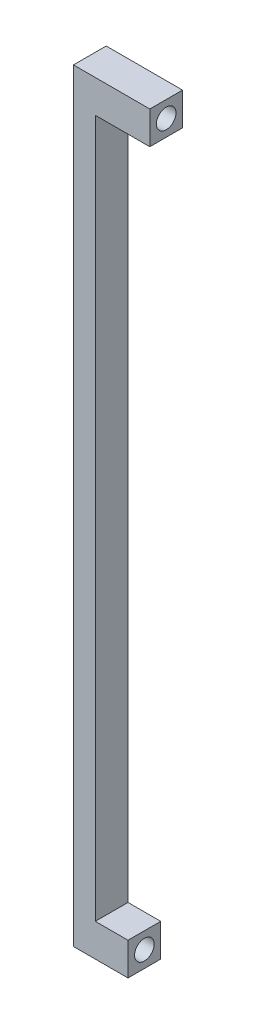
ISO-10303-21;
HEADER;
FILE_DESCRIPTION(('STEP AP214'),'2;1');
FILE_NAME('part.step','',(''),(''),'','','');
FILE_SCHEMA(('AUTOMOTIVE_DESIGN { 1 0 10303 214 1 1 1 1 }'));
ENDSEC;
DATA;
#1=APPLICATION_CONTEXT('core data for automotive mechanical design processes');
#2=APPLICATION_PROTOCOL_DEFINITION('international standard','automotive_design',2000,#1);
#3=PRODUCT_CONTEXT('',#1,'mechanical');
#4=PRODUCT('Part','Part','',(#3));
#5=PRODUCT_RELATED_PRODUCT_CATEGORY('part','',(#4));
#6=PRODUCT_DEFINITION_FORMATION('','',#4);
#7=PRODUCT_DEFINITION_CONTEXT('part definition',#1,'design');
#8=PRODUCT_DEFINITION('design','',#6,#7);
#9=PRODUCT_DEFINITION_SHAPE('','',#8);
#10=(LENGTH_UNIT() NAMED_UNIT(*) SI_UNIT(.MILLI.,.METRE.));
#11=(NAMED_UNIT(*) PLANE_ANGLE_UNIT() SI_UNIT($,.RADIAN.));
#12=(NAMED_UNIT(*) SI_UNIT($,.STERADIAN.) SOLID_ANGLE_UNIT());
#13=UNCERTAINTY_MEASURE_WITH_UNIT(LENGTH_MEASURE(1.E-05),#10,'distance_accuracy_value','');
#14=(GEOMETRIC_REPRESENTATION_CONTEXT(3) GLOBAL_UNCERTAINTY_ASSIGNED_CONTEXT((#13)) GLOBAL_UNIT_ASSIGNED_CONTEXT((#10,
#11,#12)) REPRESENTATION_CONTEXT('',''));
#15=CARTESIAN_POINT('',(0.,0.,0.));
#16=DIRECTION('',(0.,0.,1.));
#17=DIRECTION('',(1.,0.,0.));
#18=AXIS2_PLACEMENT_3D('',#15,#16,#17);
#19=CARTESIAN_POINT('',(14.,0.,6.));
#20=DIRECTION('',(1.,0.,0.));
#21=DIRECTION('',(0.,1.,0.));
#22=AXIS2_PLACEMENT_3D('',#19,#20,#21);
#23=PLANE('',#22);
#24=CARTESIAN_POINT('',(14.,137.,3.));
#25=DIRECTION('',(1.,0.,0.));
#26=DIRECTION('',(0.,0.,-1.));
#27=AXIS2_PLACEMENT_3D('',#24,#25,#26);
#28=CIRCLE('',#27,1.8);
#29=CARTESIAN_POINT('',(14.,137.,1.2));
#30=VERTEX_POINT('',#29);
#31=EDGE_CURVE('E187',#30,#30,#28,.T.);
#32=ORIENTED_EDGE('',*,*,#31,.F.);
#33=EDGE_LOOP('',(#32));
#34=FACE_BOUND('',#33,.T.);
#35=DIRECTION('',(0.,-1.,0.));
#36=VECTOR('',#35,1.);
#37=CARTESIAN_POINT('',(14.,0.,0.));
#38=LINE('',#37,#36);
#39=CARTESIAN_POINT('',(14.,140.,0.));
#40=VERTEX_POINT('',#39);
#41=CARTESIAN_POINT('',(14.,134.,0.));
#42=VERTEX_POINT('',#41);
#43=EDGE_CURVE('E129',#40,#42,#38,.T.);
#44=ORIENTED_EDGE('',*,*,#43,.F.);
#45=DIRECTION('',(0.,0.,-1.));
#46=VECTOR('',#45,1.);
#47=CARTESIAN_POINT('',(14.,140.,6.));
#48=LINE('',#47,#46);
#49=CARTESIAN_POINT('',(14.,140.,6.));
#50=VERTEX_POINT('',#49);
#51=EDGE_CURVE('E11',#50,#40,#48,.T.);
#52=ORIENTED_EDGE('',*,*,#51,.F.);
#53=DIRECTION('',(0.,-1.,0.));
#54=VECTOR('',#53,1.);
#55=CARTESIAN_POINT('',(14.,0.,6.));
#56=LINE('',#55,#54);
#57=CARTESIAN_POINT('',(14.,134.,6.));
#58=VERTEX_POINT('',#57);
#59=EDGE_CURVE('E148',#50,#58,#56,.T.);
#60=ORIENTED_EDGE('',*,*,#59,.T.);
#61=DIRECTION('',(0.,0.,-1.));
#62=VECTOR('',#61,1.);
#63=CARTESIAN_POINT('',(14.,134.,6.));
#64=LINE('',#63,#62);
#65=EDGE_CURVE('E84',#58,#42,#64,.T.);
#66=ORIENTED_EDGE('',*,*,#65,.T.);
#67=EDGE_LOOP('',(#44,#52,#60,#66));
#68=FACE_BOUND('',#67,.T.);
#69=ADVANCED_FACE('F33',(#34,#68),#23,.T.);
#70=CARTESIAN_POINT('',(0.,140.,6.));
#71=DIRECTION('',(0.,1.,0.));
#72=DIRECTION('',(0.,0.,1.));
#73=AXIS2_PLACEMENT_3D('',#70,#71,#72);
#74=PLANE('',#73);
#75=DIRECTION('',(1.,0.,0.));
#76=VECTOR('',#75,1.);
#77=CARTESIAN_POINT('',(0.,140.,0.));
#78=LINE('',#77,#76);
#79=CARTESIAN_POINT('',(0.,140.,0.));
#80=VERTEX_POINT('',#79);
#81=EDGE_CURVE('E132',#80,#40,#78,.T.);
#82=ORIENTED_EDGE('',*,*,#81,.F.);
#83=DIRECTION('',(0.,0.,-1.));
#84=VECTOR('',#83,1.);
#85=CARTESIAN_POINT('',(0.,140.,6.));
#86=LINE('',#85,#84);
#87=CARTESIAN_POINT('',(0.,140.,6.));
#88=VERTEX_POINT('',#87);
#89=EDGE_CURVE('E41',#88,#80,#86,.T.);
#90=ORIENTED_EDGE('',*,*,#89,.F.);
#91=DIRECTION('',(1.,0.,0.));
#92=VECTOR('',#91,1.);
#93=CARTESIAN_POINT('',(0.,140.,6.));
#94=LINE('',#93,#92);
#95=EDGE_CURVE('E180',#88,#50,#94,.T.);
#96=ORIENTED_EDGE('',*,*,#95,.T.);
#97=ORIENTED_EDGE('',*,*,#51,.T.);
#98=EDGE_LOOP('',(#82,#90,#96,#97));
#99=FACE_BOUND('',#98,.T.);
#100=ADVANCED_FACE('F166',(#99),#74,.T.);
#101=CARTESIAN_POINT('',(0.,0.,6.));
#102=DIRECTION('',(-1.,0.,0.));
#103=DIRECTION('',(0.,-1.,0.));
#104=AXIS2_PLACEMENT_3D('',#101,#102,#103);
#105=PLANE('',#104);
#106=DIRECTION('',(0.,1.,0.));
#107=VECTOR('',#106,1.);
#108=CARTESIAN_POINT('',(0.,0.,0.));
#109=LINE('',#108,#107);
#110=CARTESIAN_POINT('',(0.,0.,0.));
#111=VERTEX_POINT('',#110);
#112=EDGE_CURVE('E136',#111,#80,#109,.T.);
#113=ORIENTED_EDGE('',*,*,#112,.F.);
#114=DIRECTION('',(0.,0.,-1.));
#115=VECTOR('',#114,1.);
#116=CARTESIAN_POINT('',(0.,0.,6.));
#117=LINE('',#116,#115);
#118=CARTESIAN_POINT('',(0.,0.,6.));
#119=VERTEX_POINT('',#118);
#120=EDGE_CURVE('E155',#119,#111,#117,.T.);
#121=ORIENTED_EDGE('',*,*,#120,.F.);
#122=DIRECTION('',(0.,1.,0.));
#123=VECTOR('',#122,1.);
#124=CARTESIAN_POINT('',(0.,0.,6.));
#125=LINE('',#124,#123);
#126=EDGE_CURVE('E162',#119,#88,#125,.T.);
#127=ORIENTED_EDGE('',*,*,#126,.T.);
#128=ORIENTED_EDGE('',*,*,#89,.T.);
#129=EDGE_LOOP('',(#113,#121,#127,#128));
#130=FACE_BOUND('',#129,.T.);
#131=ADVANCED_FACE('F160',(#130),#105,.T.);
#132=CARTESIAN_POINT('',(0.,0.,6.));
#133=DIRECTION('',(0.,1.,0.));
#134=DIRECTION('',(0.,0.,1.));
#135=AXIS2_PLACEMENT_3D('',#132,#133,#134);
#136=PLANE('',#135);
#137=DIRECTION('',(1.,0.,0.));
#138=VECTOR('',#137,1.);
#139=CARTESIAN_POINT('',(0.,0.,0.));
#140=LINE('',#139,#138);
#141=CARTESIAN_POINT('',(10.,0.,0.));
#142=VERTEX_POINT('',#141);
#143=EDGE_CURVE('E139',#111,#142,#140,.T.);
#144=ORIENTED_EDGE('',*,*,#143,.T.);
#145=DIRECTION('',(0.,0.,-1.));
#146=VECTOR('',#145,1.);
#147=CARTESIAN_POINT('',(10.,0.,6.));
#148=LINE('',#147,#146);
#149=CARTESIAN_POINT('',(10.,0.,6.));
#150=VERTEX_POINT('',#149);
#151=EDGE_CURVE('E152',#150,#142,#148,.T.);
#152=ORIENTED_EDGE('',*,*,#151,.F.);
#153=DIRECTION('',(1.,0.,0.));
#154=VECTOR('',#153,1.);
#155=CARTESIAN_POINT('',(0.,0.,6.));
#156=LINE('',#155,#154);
#157=EDGE_CURVE('E124',#119,#150,#156,.T.);
#158=ORIENTED_EDGE('',*,*,#157,.F.);
#159=ORIENTED_EDGE('',*,*,#120,.T.);
#160=EDGE_LOOP('',(#144,#152,#158,#159));
#161=FACE_BOUND('',#160,.T.);
#162=ADVANCED_FACE('F173',(#161),#136,.F.);
#163=CARTESIAN_POINT('',(10.,0.,6.));
#164=DIRECTION('',(-1.,0.,0.));
#165=DIRECTION('',(0.,-1.,0.));
#166=AXIS2_PLACEMENT_3D('',#163,#164,#165);
#167=PLANE('',#166);
#168=CARTESIAN_POINT('',(10.,3.,3.));
#169=DIRECTION('',(1.,0.,0.));
#170=DIRECTION('',(0.,0.,-1.));
#171=AXIS2_PLACEMENT_3D('',#168,#169,#170);
#172=CIRCLE('',#171,1.79999999999999);
#173=CARTESIAN_POINT('',(10.,3.,1.20000000000001));
#174=VERTEX_POINT('',#173);
#175=EDGE_CURVE('E193',#174,#174,#172,.T.);
#176=ORIENTED_EDGE('',*,*,#175,.F.);
#177=EDGE_LOOP('',(#176));
#178=FACE_BOUND('',#177,.T.);
#179=DIRECTION('',(0.,1.,0.));
#180=VECTOR('',#179,1.);
#181=CARTESIAN_POINT('',(10.,0.,0.));
#182=LINE('',#181,#180);
#183=CARTESIAN_POINT('',(10.,6.,0.));
#184=VERTEX_POINT('',#183);
#185=EDGE_CURVE('E141',#142,#184,#182,.T.);
#186=ORIENTED_EDGE('',*,*,#185,.T.);
#187=DIRECTION('',(0.,0.,-1.));
#188=VECTOR('',#187,1.);
#189=CARTESIAN_POINT('',(10.,6.,6.));
#190=LINE('',#189,#188);
#191=CARTESIAN_POINT('',(10.,6.,6.));
#192=VERTEX_POINT('',#191);
#193=EDGE_CURVE('E113',#192,#184,#190,.T.);
#194=ORIENTED_EDGE('',*,*,#193,.F.);
#195=DIRECTION('',(0.,1.,0.));
#196=VECTOR('',#195,1.);
#197=CARTESIAN_POINT('',(10.,0.,6.));
#198=LINE('',#197,#196);
#199=EDGE_CURVE('E121',#150,#192,#198,.T.);
#200=ORIENTED_EDGE('',*,*,#199,.F.);
#201=ORIENTED_EDGE('',*,*,#151,.T.);
#202=EDGE_LOOP('',(#186,#194,#200,#201));
#203=FACE_BOUND('',#202,.T.);
#204=ADVANCED_FACE('F176',(#178,#203),#167,.F.);
#205=CARTESIAN_POINT('',(0.,6.,6.));
#206=DIRECTION('',(0.,1.,0.));
#207=DIRECTION('',(0.,0.,1.));
#208=AXIS2_PLACEMENT_3D('',#205,#206,#207);
#209=PLANE('',#208);
#210=DIRECTION('',(1.,0.,0.));
#211=VECTOR('',#210,1.);
#212=CARTESIAN_POINT('',(0.,6.,0.));
#213=LINE('',#212,#211);
#214=CARTESIAN_POINT('',(4.,6.,0.));
#215=VERTEX_POINT('',#214);
#216=EDGE_CURVE('E112',#215,#184,#213,.T.);
#217=ORIENTED_EDGE('',*,*,#216,.F.);
#218=DIRECTION('',(0.,0.,-1.));
#219=VECTOR('',#218,1.);
#220=CARTESIAN_POINT('',(4.,6.,6.));
#221=LINE('',#220,#219);
#222=CARTESIAN_POINT('',(4.,6.,6.));
#223=VERTEX_POINT('',#222);
#224=EDGE_CURVE('E106',#223,#215,#221,.T.);
#225=ORIENTED_EDGE('',*,*,#224,.F.);
#226=DIRECTION('',(1.,0.,0.));
#227=VECTOR('',#226,1.);
#228=CARTESIAN_POINT('',(0.,6.,6.));
#229=LINE('',#228,#227);
#230=EDGE_CURVE('E110',#223,#192,#229,.T.);
#231=ORIENTED_EDGE('',*,*,#230,.T.);
#232=ORIENTED_EDGE('',*,*,#193,.T.);
#233=EDGE_LOOP('',(#217,#225,#231,#232));
#234=FACE_BOUND('',#233,.T.);
#235=ADVANCED_FACE('F108',(#234),#209,.T.);
#236=CARTESIAN_POINT('',(4.,0.,6.));
#237=DIRECTION('',(-1.,0.,0.));
#238=DIRECTION('',(0.,0.,1.));
#239=AXIS2_PLACEMENT_3D('',#236,#237,#238);
#240=PLANE('',#239);
#241=DIRECTION('',(0.,1.,0.));
#242=VECTOR('',#241,1.);
#243=CARTESIAN_POINT('',(4.,0.,0.));
#244=LINE('',#243,#242);
#245=CARTESIAN_POINT('',(4.,134.,0.));
#246=VERTEX_POINT('',#245);
#247=EDGE_CURVE('E77',#215,#246,#244,.T.);
#248=ORIENTED_EDGE('',*,*,#247,.T.);
#249=DIRECTION('',(0.,0.,-1.));
#250=VECTOR('',#249,1.);
#251=CARTESIAN_POINT('',(4.,134.,6.));
#252=LINE('',#251,#250);
#253=CARTESIAN_POINT('',(4.,134.,6.));
#254=VERTEX_POINT('',#253);
#255=EDGE_CURVE('E114',#254,#246,#252,.T.);
#256=ORIENTED_EDGE('',*,*,#255,.F.);
#257=DIRECTION('',(0.,1.,0.));
#258=VECTOR('',#257,1.);
#259=CARTESIAN_POINT('',(4.,0.,6.));
#260=LINE('',#259,#258);
#261=EDGE_CURVE('E116',#223,#254,#260,.T.);
#262=ORIENTED_EDGE('',*,*,#261,.F.);
#263=ORIENTED_EDGE('',*,*,#224,.T.);
#264=EDGE_LOOP('',(#248,#256,#262,#263));
#265=FACE_BOUND('',#264,.T.);
#266=ADVANCED_FACE('F117',(#265),#240,.F.);
#267=CARTESIAN_POINT('',(0.,134.,6.));
#268=DIRECTION('',(0.,1.,0.));
#269=DIRECTION('',(0.,0.,1.));
#270=AXIS2_PLACEMENT_3D('',#267,#268,#269);
#271=PLANE('',#270);
#272=DIRECTION('',(1.,0.,0.));
#273=VECTOR('',#272,1.);
#274=CARTESIAN_POINT('',(0.,134.,0.));
#275=LINE('',#274,#273);
#276=EDGE_CURVE('E146',#246,#42,#275,.T.);
#277=ORIENTED_EDGE('',*,*,#276,.T.);
#278=ORIENTED_EDGE('',*,*,#65,.F.);
#279=DIRECTION('',(1.,0.,0.));
#280=VECTOR('',#279,1.);
#281=CARTESIAN_POINT('',(0.,134.,6.));
#282=LINE('',#281,#280);
#283=EDGE_CURVE('E49',#254,#58,#282,.T.);
#284=ORIENTED_EDGE('',*,*,#283,.F.);
#285=ORIENTED_EDGE('',*,*,#255,.T.);
#286=EDGE_LOOP('',(#277,#278,#284,#285));
#287=FACE_BOUND('',#286,.T.);
#288=ADVANCED_FACE('F179',(#287),#271,.F.);
#289=CARTESIAN_POINT('',(0.,0.,6.));
#290=DIRECTION('',(0.,0.,1.));
#291=DIRECTION('',(1.,0.,0.));
#292=AXIS2_PLACEMENT_3D('',#289,#290,#291);
#293=PLANE('',#292);
#294=ORIENTED_EDGE('',*,*,#59,.F.);
#295=ORIENTED_EDGE('',*,*,#95,.F.);
#296=ORIENTED_EDGE('',*,*,#126,.F.);
#297=ORIENTED_EDGE('',*,*,#157,.T.);
#298=ORIENTED_EDGE('',*,*,#199,.T.);
#299=ORIENTED_EDGE('',*,*,#230,.F.);
#300=ORIENTED_EDGE('',*,*,#261,.T.);
#301=ORIENTED_EDGE('',*,*,#283,.T.);
#302=EDGE_LOOP('',(#294,#295,#296,#297,#298,#299,#300,#301));
#303=FACE_BOUND('',#302,.T.);
#304=ADVANCED_FACE('F119',(#303),#293,.T.);
#305=CARTESIAN_POINT('',(0.,0.,0.));
#306=DIRECTION('',(0.,0.,1.));
#307=DIRECTION('',(1.,0.,0.));
#308=AXIS2_PLACEMENT_3D('',#305,#306,#307);
#309=PLANE('',#308);
#310=ORIENTED_EDGE('',*,*,#43,.T.);
#311=ORIENTED_EDGE('',*,*,#276,.F.);
#312=ORIENTED_EDGE('',*,*,#247,.F.);
#313=ORIENTED_EDGE('',*,*,#216,.T.);
#314=ORIENTED_EDGE('',*,*,#185,.F.);
#315=ORIENTED_EDGE('',*,*,#143,.F.);
#316=ORIENTED_EDGE('',*,*,#112,.T.);
#317=ORIENTED_EDGE('',*,*,#81,.T.);
#318=EDGE_LOOP('',(#310,#311,#312,#313,#314,#315,#316,#317));
#319=FACE_BOUND('',#318,.T.);
#320=ADVANCED_FACE('F169',(#319),#309,.F.);
#321=CARTESIAN_POINT('',(11.,137.,3.));
#322=DIRECTION('',(1.,0.,0.));
#323=DIRECTION('',(0.,0.,-1.));
#324=AXIS2_PLACEMENT_3D('',#321,#322,#323);
#325=CONICAL_SURFACE('',#324,1.8,1.02974425867665);
#326=CARTESIAN_POINT('',(9.91845088575039,137.,3.));
#327=VERTEX_POINT('',#326);
#328=VERTEX_LOOP('',#327);
#329=FACE_BOUND('',#328,.T.);
#330=CARTESIAN_POINT('',(11.,137.,3.));
#331=DIRECTION('',(1.,0.,0.));
#332=DIRECTION('',(0.,0.,-1.));
#333=AXIS2_PLACEMENT_3D('',#330,#331,#332);
#334=CIRCLE('',#333,1.8);
#335=CARTESIAN_POINT('',(11.,137.,1.2));
#336=VERTEX_POINT('',#335);
#337=EDGE_CURVE('E133',#336,#336,#334,.T.);
#338=ORIENTED_EDGE('',*,*,#337,.T.);
#339=EDGE_LOOP('',(#338));
#340=FACE_BOUND('',#339,.T.);
#341=ADVANCED_FACE('F217',(#329,#340),#325,.F.);
#342=CARTESIAN_POINT('',(14.,137.,3.));
#343=DIRECTION('',(1.,0.,0.));
#344=DIRECTION('',(0.,0.,-1.));
#345=AXIS2_PLACEMENT_3D('',#342,#343,#344);
#346=CYLINDRICAL_SURFACE('',#345,1.8);
#347=ORIENTED_EDGE('',*,*,#337,.F.);
#348=EDGE_LOOP('',(#347));
#349=FACE_BOUND('',#348,.T.);
#350=ORIENTED_EDGE('',*,*,#31,.T.);
#351=EDGE_LOOP('',(#350));
#352=FACE_BOUND('',#351,.T.);
#353=ADVANCED_FACE('F214',(#349,#352),#346,.F.);
#354=CARTESIAN_POINT('',(1.4,3.,3.));
#355=DIRECTION('',(1.,0.,0.));
#356=DIRECTION('',(0.,0.,-1.));
#357=AXIS2_PLACEMENT_3D('',#354,#355,#356);
#358=CONICAL_SURFACE('',#357,1.8,1.02974425867665);
#359=CARTESIAN_POINT('',(0.318450885750389,3.,3.));
#360=VERTEX_POINT('',#359);
#361=VERTEX_LOOP('',#360);
#362=FACE_BOUND('',#361,.T.);
#363=CARTESIAN_POINT('',(1.4,3.,3.));
#364=DIRECTION('',(1.,0.,0.));
#365=DIRECTION('',(0.,0.,-1.));
#366=AXIS2_PLACEMENT_3D('',#363,#364,#365);
#367=CIRCLE('',#366,1.8);
#368=CARTESIAN_POINT('',(1.4,3.,1.2));
#369=VERTEX_POINT('',#368);
#370=EDGE_CURVE('E190',#369,#369,#367,.T.);
#371=ORIENTED_EDGE('',*,*,#370,.T.);
#372=EDGE_LOOP('',(#371));
#373=FACE_BOUND('',#372,.T.);
#374=ADVANCED_FACE('F216',(#362,#373),#358,.F.);
#375=CARTESIAN_POINT('',(10.,3.,3.));
#376=DIRECTION('',(1.,0.,0.));
#377=DIRECTION('',(0.,0.,-1.));
#378=AXIS2_PLACEMENT_3D('',#375,#376,#377);
#379=CYLINDRICAL_SURFACE('',#378,1.79999999999999);
#380=ORIENTED_EDGE('',*,*,#370,.F.);
#381=EDGE_LOOP('',(#380));
#382=FACE_BOUND('',#381,.T.);
#383=ORIENTED_EDGE('',*,*,#175,.T.);
#384=EDGE_LOOP('',(#383));
#385=FACE_BOUND('',#384,.T.);
#386=ADVANCED_FACE('F197',(#382,#385),#379,.F.);
#387=CLOSED_SHELL('',(#69,#100,#131,#162,#204,#235,#266,#288,#304,#320,#341,#353,#374,#386));
#388=MANIFOLD_SOLID_BREP('B2',#387);
#389=ADVANCED_BREP_SHAPE_REPRESENTATION('',(#18,#388),#14);
#390=SHAPE_DEFINITION_REPRESENTATION(#9,#389);
ENDSEC;
END-ISO-10303-21;
